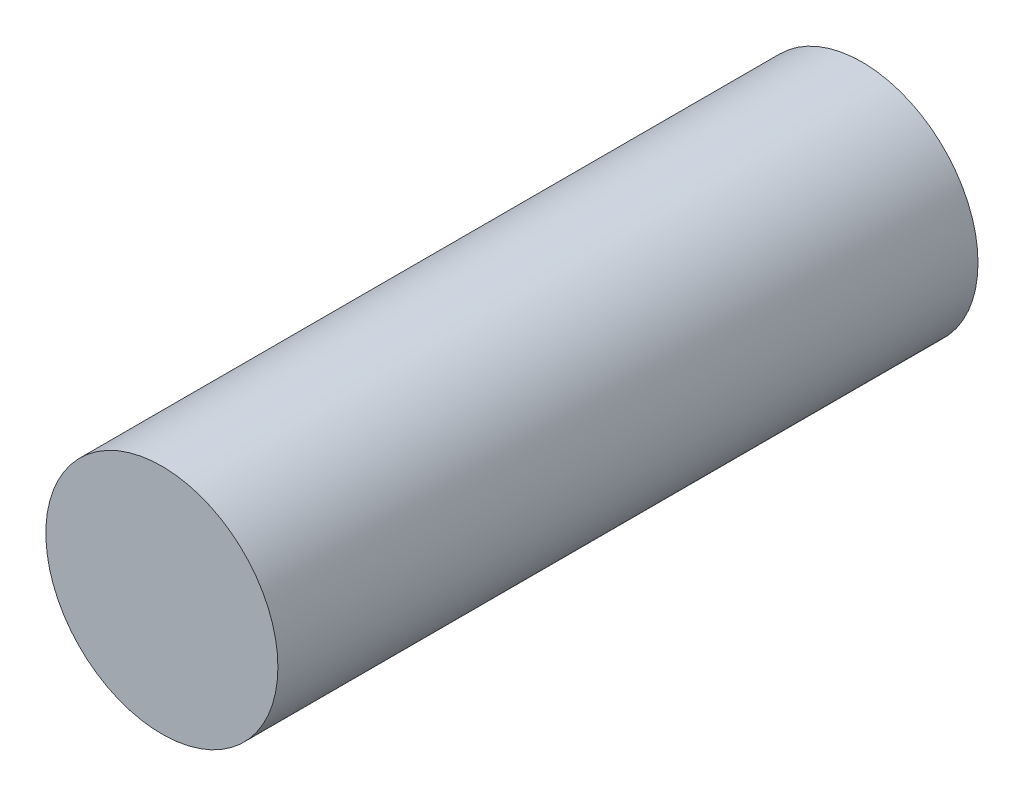
ISO-10303-21;
HEADER;
FILE_DESCRIPTION(('STEP AP214'),'2;1');
FILE_NAME('part.step','',(''),(''),'','','');
FILE_SCHEMA(('AUTOMOTIVE_DESIGN { 1 0 10303 214 1 1 1 1 }'));
ENDSEC;
DATA;
#1=APPLICATION_CONTEXT('core data for automotive mechanical design processes');
#2=APPLICATION_PROTOCOL_DEFINITION('international standard','automotive_design',2000,#1);
#3=PRODUCT_CONTEXT('',#1,'mechanical');
#4=PRODUCT('Part','Part','',(#3));
#5=PRODUCT_RELATED_PRODUCT_CATEGORY('part','',(#4));
#6=PRODUCT_DEFINITION_FORMATION('','',#4);
#7=PRODUCT_DEFINITION_CONTEXT('part definition',#1,'design');
#8=PRODUCT_DEFINITION('design','',#6,#7);
#9=PRODUCT_DEFINITION_SHAPE('','',#8);
#10=(LENGTH_UNIT() NAMED_UNIT(*) SI_UNIT(.MILLI.,.METRE.));
#11=(NAMED_UNIT(*) PLANE_ANGLE_UNIT() SI_UNIT($,.RADIAN.));
#12=(NAMED_UNIT(*) SI_UNIT($,.STERADIAN.) SOLID_ANGLE_UNIT());
#13=UNCERTAINTY_MEASURE_WITH_UNIT(LENGTH_MEASURE(1.E-05),#10,'distance_accuracy_value','');
#14=(GEOMETRIC_REPRESENTATION_CONTEXT(3) GLOBAL_UNCERTAINTY_ASSIGNED_CONTEXT((#13)) GLOBAL_UNIT_ASSIGNED_CONTEXT((#10,
#11,#12)) REPRESENTATION_CONTEXT('',''));
#15=CARTESIAN_POINT('',(0.,0.,0.));
#16=DIRECTION('',(0.,0.,1.));
#17=DIRECTION('',(1.,0.,0.));
#18=AXIS2_PLACEMENT_3D('',#15,#16,#17);
#19=CARTESIAN_POINT('',(0.,0.,-9.779));
#20=DIRECTION('',(0.,0.,1.));
#21=DIRECTION('',(1.,0.,0.));
#22=AXIS2_PLACEMENT_3D('',#19,#20,#21);
#23=PLANE('',#22);
#24=CARTESIAN_POINT('',(0.,0.,-9.779));
#25=DIRECTION('',(0.,0.,1.));
#26=DIRECTION('',(1.,0.,0.));
#27=AXIS2_PLACEMENT_3D('',#24,#25,#26);
#28=CIRCLE('',#27,3.175);
#29=CARTESIAN_POINT('',(3.175,0.,-9.779));
#30=VERTEX_POINT('',#29);
#31=EDGE_CURVE('E19',#30,#30,#28,.T.);
#32=ORIENTED_EDGE('',*,*,#31,.F.);
#33=EDGE_LOOP('',(#32));
#34=FACE_BOUND('',#33,.T.);
#35=ADVANCED_FACE('F15',(#34),#23,.F.);
#36=CARTESIAN_POINT('',(0.,0.,9.379));
#37=DIRECTION('',(0.,0.,1.));
#38=DIRECTION('',(1.,0.,0.));
#39=AXIS2_PLACEMENT_3D('',#36,#37,#38);
#40=PLANE('',#39);
#41=CARTESIAN_POINT('',(0.,0.,9.379));
#42=DIRECTION('',(0.,0.,1.));
#43=DIRECTION('',(1.,0.,0.));
#44=AXIS2_PLACEMENT_3D('',#41,#42,#43);
#45=CIRCLE('',#44,3.175);
#46=CARTESIAN_POINT('',(3.175,0.,9.379));
#47=VERTEX_POINT('',#46);
#48=EDGE_CURVE('E10',#47,#47,#45,.T.);
#49=ORIENTED_EDGE('',*,*,#48,.T.);
#50=EDGE_LOOP('',(#49));
#51=FACE_BOUND('',#50,.T.);
#52=ADVANCED_FACE('F17',(#51),#40,.T.);
#53=CARTESIAN_POINT('',(0.,0.,-12.465));
#54=DIRECTION('',(0.,0.,1.));
#55=DIRECTION('',(1.,0.,0.));
#56=AXIS2_PLACEMENT_3D('',#53,#54,#55);
#57=CYLINDRICAL_SURFACE('',#56,3.175);
#58=ORIENTED_EDGE('',*,*,#48,.F.);
#59=EDGE_LOOP('',(#58));
#60=FACE_BOUND('',#59,.T.);
#61=ORIENTED_EDGE('',*,*,#31,.T.);
#62=EDGE_LOOP('',(#61));
#63=FACE_BOUND('',#62,.T.);
#64=ADVANCED_FACE('F28',(#60,#63),#57,.T.);
#65=CLOSED_SHELL('',(#35,#52,#64));
#66=MANIFOLD_SOLID_BREP('B1',#65);
#67=ADVANCED_BREP_SHAPE_REPRESENTATION('',(#18,#66),#14);
#68=SHAPE_DEFINITION_REPRESENTATION(#9,#67);
ENDSEC;
END-ISO-10303-21;
